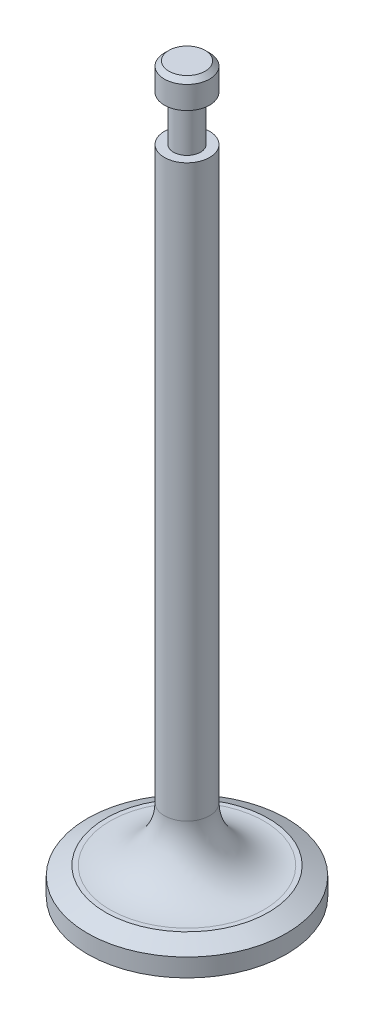
ISO-10303-21;
HEADER;
FILE_DESCRIPTION(('STEP AP214'),'2;1');
FILE_NAME('part.step','',(''),(''),'','','');
FILE_SCHEMA(('AUTOMOTIVE_DESIGN { 1 0 10303 214 1 1 1 1 }'));
ENDSEC;
DATA;
#1=APPLICATION_CONTEXT('core data for automotive mechanical design processes');
#2=APPLICATION_PROTOCOL_DEFINITION('international standard','automotive_design',2000,#1);
#3=PRODUCT_CONTEXT('',#1,'mechanical');
#4=PRODUCT('Part','Part','',(#3));
#5=PRODUCT_RELATED_PRODUCT_CATEGORY('part','',(#4));
#6=PRODUCT_DEFINITION_FORMATION('','',#4);
#7=PRODUCT_DEFINITION_CONTEXT('part definition',#1,'design');
#8=PRODUCT_DEFINITION('design','',#6,#7);
#9=PRODUCT_DEFINITION_SHAPE('','',#8);
#10=(LENGTH_UNIT() NAMED_UNIT(*) SI_UNIT(.MILLI.,.METRE.));
#11=(NAMED_UNIT(*) PLANE_ANGLE_UNIT() SI_UNIT($,.RADIAN.));
#12=(NAMED_UNIT(*) SI_UNIT($,.STERADIAN.) SOLID_ANGLE_UNIT());
#13=UNCERTAINTY_MEASURE_WITH_UNIT(LENGTH_MEASURE(1.E-05),#10,'distance_accuracy_value','');
#14=(GEOMETRIC_REPRESENTATION_CONTEXT(3) GLOBAL_UNCERTAINTY_ASSIGNED_CONTEXT((#13)) GLOBAL_UNIT_ASSIGNED_CONTEXT((#10,
#11,#12)) REPRESENTATION_CONTEXT('',''));
#15=CARTESIAN_POINT('',(0.,0.,0.));
#16=DIRECTION('',(0.,0.,1.));
#17=DIRECTION('',(1.,0.,0.));
#18=AXIS2_PLACEMENT_3D('',#15,#16,#17);
#19=CARTESIAN_POINT('',(11.,0.,0.));
#20=DIRECTION('',(0.,-1.,0.));
#21=DIRECTION('',(0.,0.,-1.));
#22=AXIS2_PLACEMENT_3D('',#19,#20,#21);
#23=PLANE('',#22);
#24=CARTESIAN_POINT('',(0.,0.,0.));
#25=DIRECTION('',(0.,-1.,0.));
#26=DIRECTION('',(0.,0.,-1.));
#27=AXIS2_PLACEMENT_3D('',#24,#25,#26);
#28=CIRCLE('',#27,11.);
#29=CARTESIAN_POINT('',(0.,0.,-11.));
#30=VERTEX_POINT('',#29);
#31=EDGE_CURVE('E76',#30,#30,#28,.T.);
#32=ORIENTED_EDGE('',*,*,#31,.T.);
#33=EDGE_LOOP('',(#32));
#34=FACE_BOUND('',#33,.T.);
#35=ADVANCED_FACE('F37',(#34),#23,.T.);
#36=CARTESIAN_POINT('',(0.,80.,0.));
#37=DIRECTION('',(0.,1.,0.));
#38=DIRECTION('',(0.,0.,1.));
#39=AXIS2_PLACEMENT_3D('',#36,#37,#38);
#40=PLANE('',#39);
#41=CARTESIAN_POINT('',(0.,80.,0.));
#42=DIRECTION('',(0.,1.,0.));
#43=DIRECTION('',(0.,0.,1.));
#44=AXIS2_PLACEMENT_3D('',#41,#42,#43);
#45=CIRCLE('',#44,2.00000000000001);
#46=CARTESIAN_POINT('',(0.,80.,2.00000000000001));
#47=VERTEX_POINT('',#46);
#48=EDGE_CURVE('E49',#47,#47,#45,.T.);
#49=ORIENTED_EDGE('',*,*,#48,.T.);
#50=EDGE_LOOP('',(#49));
#51=FACE_BOUND('',#50,.T.);
#52=ADVANCED_FACE('F96',(#51),#40,.T.);
#53=CARTESIAN_POINT('',(0.,0.,0.));
#54=DIRECTION('',(0.,-1.,0.));
#55=DIRECTION('',(0.,0.,-1.));
#56=AXIS2_PLACEMENT_3D('',#53,#54,#55);
#57=CYLINDRICAL_SURFACE('',#56,2.5);
#58=CARTESIAN_POINT('',(0.,79.5,0.));
#59=DIRECTION('',(0.,1.,0.));
#60=DIRECTION('',(0.,0.,1.));
#61=AXIS2_PLACEMENT_3D('',#58,#59,#60);
#62=CIRCLE('',#61,2.5);
#63=CARTESIAN_POINT('',(0.,79.5,2.5));
#64=VERTEX_POINT('',#63);
#65=EDGE_CURVE('E53',#64,#64,#62,.F.);
#66=ORIENTED_EDGE('',*,*,#65,.T.);
#67=EDGE_LOOP('',(#66));
#68=FACE_BOUND('',#67,.T.);
#69=CARTESIAN_POINT('',(0.,77.,0.));
#70=DIRECTION('',(0.,-1.,0.));
#71=DIRECTION('',(0.,0.,-1.));
#72=AXIS2_PLACEMENT_3D('',#69,#70,#71);
#73=CIRCLE('',#72,2.5);
#74=CARTESIAN_POINT('',(0.,77.,-2.5));
#75=VERTEX_POINT('',#74);
#76=EDGE_CURVE('E64',#75,#75,#73,.T.);
#77=ORIENTED_EDGE('',*,*,#76,.F.);
#78=EDGE_LOOP('',(#77));
#79=FACE_BOUND('',#78,.T.);
#80=ADVANCED_FACE('F101',(#68,#79),#57,.T.);
#81=CARTESIAN_POINT('',(2.5,77.,0.));
#82=DIRECTION('',(0.,-1.,0.));
#83=DIRECTION('',(0.,0.,-1.));
#84=AXIS2_PLACEMENT_3D('',#81,#82,#83);
#85=PLANE('',#84);
#86=ORIENTED_EDGE('',*,*,#76,.T.);
#87=EDGE_LOOP('',(#86));
#88=FACE_BOUND('',#87,.T.);
#89=CARTESIAN_POINT('',(0.,77.,0.));
#90=DIRECTION('',(0.,-1.,0.));
#91=DIRECTION('',(0.,0.,-1.));
#92=AXIS2_PLACEMENT_3D('',#89,#90,#91);
#93=CIRCLE('',#92,1.5);
#94=CARTESIAN_POINT('',(0.,77.,-1.5));
#95=VERTEX_POINT('',#94);
#96=EDGE_CURVE('E67',#95,#95,#93,.T.);
#97=ORIENTED_EDGE('',*,*,#96,.F.);
#98=EDGE_LOOP('',(#97));
#99=FACE_BOUND('',#98,.T.);
#100=ADVANCED_FACE('F120',(#88,#99),#85,.T.);
#101=CARTESIAN_POINT('',(0.,0.,0.));
#102=DIRECTION('',(0.,-1.,0.));
#103=DIRECTION('',(0.,0.,-1.));
#104=AXIS2_PLACEMENT_3D('',#101,#102,#103);
#105=CYLINDRICAL_SURFACE('',#104,1.5);
#106=ORIENTED_EDGE('',*,*,#96,.T.);
#107=EDGE_LOOP('',(#106));
#108=FACE_BOUND('',#107,.T.);
#109=CARTESIAN_POINT('',(0.,72.,0.));
#110=DIRECTION('',(0.,-1.,0.));
#111=DIRECTION('',(0.,0.,-1.));
#112=AXIS2_PLACEMENT_3D('',#109,#110,#111);
#113=CIRCLE('',#112,1.5);
#114=CARTESIAN_POINT('',(0.,72.,-1.5));
#115=VERTEX_POINT('',#114);
#116=EDGE_CURVE('E70',#115,#115,#113,.T.);
#117=ORIENTED_EDGE('',*,*,#116,.F.);
#118=EDGE_LOOP('',(#117));
#119=FACE_BOUND('',#118,.T.);
#120=ADVANCED_FACE('F125',(#108,#119),#105,.T.);
#121=CARTESIAN_POINT('',(1.5,72.,0.));
#122=DIRECTION('',(0.,1.,0.));
#123=DIRECTION('',(0.,0.,1.));
#124=AXIS2_PLACEMENT_3D('',#121,#122,#123);
#125=PLANE('',#124);
#126=ORIENTED_EDGE('',*,*,#116,.T.);
#127=EDGE_LOOP('',(#126));
#128=FACE_BOUND('',#127,.T.);
#129=CARTESIAN_POINT('',(0.,72.,0.));
#130=DIRECTION('',(0.,-1.,0.));
#131=DIRECTION('',(0.,0.,-1.));
#132=AXIS2_PLACEMENT_3D('',#129,#130,#131);
#133=CIRCLE('',#132,2.5);
#134=CARTESIAN_POINT('',(0.,72.,-2.5));
#135=VERTEX_POINT('',#134);
#136=EDGE_CURVE('E73',#135,#135,#133,.T.);
#137=ORIENTED_EDGE('',*,*,#136,.F.);
#138=EDGE_LOOP('',(#137));
#139=FACE_BOUND('',#138,.T.);
#140=ADVANCED_FACE('F131',(#128,#139),#125,.T.);
#141=CARTESIAN_POINT('',(0.,0.,0.));
#142=DIRECTION('',(0.,-1.,0.));
#143=DIRECTION('',(0.,0.,-1.));
#144=AXIS2_PLACEMENT_3D('',#141,#142,#143);
#145=CYLINDRICAL_SURFACE('',#144,2.5);
#146=CARTESIAN_POINT('',(0.,9.,0.));
#147=DIRECTION('',(0.,1.,0.));
#148=DIRECTION('',(0.,0.,1.));
#149=AXIS2_PLACEMENT_3D('',#146,#147,#148);
#150=CIRCLE('',#149,2.5);
#151=CARTESIAN_POINT('',(0.,9.,2.5));
#152=VERTEX_POINT('',#151);
#153=EDGE_CURVE('E58',#152,#152,#150,.T.);
#154=ORIENTED_EDGE('',*,*,#153,.T.);
#155=EDGE_LOOP('',(#154));
#156=FACE_BOUND('',#155,.T.);
#157=ORIENTED_EDGE('',*,*,#136,.T.);
#158=EDGE_LOOP('',(#157));
#159=FACE_BOUND('',#158,.T.);
#160=ADVANCED_FACE('F93',(#156,#159),#145,.T.);
#161=CARTESIAN_POINT('',(2.50000000000001,3.,0.));
#162=DIRECTION('',(0.,1.,0.));
#163=DIRECTION('',(0.,0.,1.));
#164=AXIS2_PLACEMENT_3D('',#161,#162,#163);
#165=PLANE('',#164);
#166=CARTESIAN_POINT('',(0.,3.,0.));
#167=DIRECTION('',(0.,1.,0.));
#168=DIRECTION('',(0.,0.,1.));
#169=AXIS2_PLACEMENT_3D('',#166,#167,#168);
#170=CIRCLE('',#169,8.99999999999998);
#171=CARTESIAN_POINT('',(0.,3.,8.99999999999998));
#172=VERTEX_POINT('',#171);
#173=EDGE_CURVE('E10',#172,#172,#170,.T.);
#174=ORIENTED_EDGE('',*,*,#173,.T.);
#175=EDGE_LOOP('',(#174));
#176=FACE_BOUND('',#175,.T.);
#177=CARTESIAN_POINT('',(0.,3.,0.));
#178=DIRECTION('',(0.,1.,0.));
#179=DIRECTION('',(0.,0.,1.));
#180=AXIS2_PLACEMENT_3D('',#177,#178,#179);
#181=CIRCLE('',#180,8.5);
#182=CARTESIAN_POINT('',(0.,3.,8.5));
#183=VERTEX_POINT('',#182);
#184=EDGE_CURVE('E61',#183,#183,#181,.F.);
#185=ORIENTED_EDGE('',*,*,#184,.T.);
#186=EDGE_LOOP('',(#185));
#187=FACE_BOUND('',#186,.T.);
#188=ADVANCED_FACE('F84',(#176,#187),#165,.T.);
#189=CARTESIAN_POINT('',(0.,0.,0.));
#190=DIRECTION('',(0.,-1.,0.));
#191=DIRECTION('',(0.,0.,-1.));
#192=AXIS2_PLACEMENT_3D('',#189,#190,#191);
#193=CYLINDRICAL_SURFACE('',#192,11.);
#194=CARTESIAN_POINT('',(0.,1.99999999999999,0.));
#195=DIRECTION('',(0.,1.,0.));
#196=DIRECTION('',(0.,0.,1.));
#197=AXIS2_PLACEMENT_3D('',#194,#195,#196);
#198=CIRCLE('',#197,11.);
#199=CARTESIAN_POINT('',(0.,1.99999999999999,11.));
#200=VERTEX_POINT('',#199);
#201=EDGE_CURVE('E45',#200,#200,#198,.F.);
#202=ORIENTED_EDGE('',*,*,#201,.T.);
#203=EDGE_LOOP('',(#202));
#204=FACE_BOUND('',#203,.T.);
#205=ORIENTED_EDGE('',*,*,#31,.F.);
#206=EDGE_LOOP('',(#205));
#207=FACE_BOUND('',#206,.T.);
#208=ADVANCED_FACE('F81',(#204,#207),#193,.T.);
#209=CARTESIAN_POINT('',(0.,9.,0.));
#210=DIRECTION('',(0.,1.,0.));
#211=DIRECTION('',(0.,0.,1.));
#212=AXIS2_PLACEMENT_3D('',#209,#210,#211);
#213=TOROIDAL_SURFACE('',#212,8.5,6.);
#214=ORIENTED_EDGE('',*,*,#153,.F.);
#215=EDGE_LOOP('',(#214));
#216=FACE_BOUND('',#215,.T.);
#217=ORIENTED_EDGE('',*,*,#184,.F.);
#218=EDGE_LOOP('',(#217));
#219=FACE_BOUND('',#218,.T.);
#220=ADVANCED_FACE('F83',(#216,#219),#213,.F.);
#221=CARTESIAN_POINT('',(0.,79.5,0.));
#222=DIRECTION('',(0.,-1.,0.));
#223=DIRECTION('',(0.,0.,-1.));
#224=AXIS2_PLACEMENT_3D('',#221,#222,#223);
#225=CONICAL_SURFACE('',#224,2.5,0.785398163397453);
#226=ORIENTED_EDGE('',*,*,#48,.F.);
#227=EDGE_LOOP('',(#226));
#228=FACE_BOUND('',#227,.T.);
#229=ORIENTED_EDGE('',*,*,#65,.F.);
#230=EDGE_LOOP('',(#229));
#231=FACE_BOUND('',#230,.T.);
#232=ADVANCED_FACE('F90',(#228,#231),#225,.T.);
#233=CARTESIAN_POINT('',(0.,1.99999999999999,0.));
#234=DIRECTION('',(0.,-1.,0.));
#235=DIRECTION('',(0.,0.,-1.));
#236=AXIS2_PLACEMENT_3D('',#233,#234,#235);
#237=CONICAL_SURFACE('',#236,11.,1.10714871779409);
#238=ORIENTED_EDGE('',*,*,#173,.F.);
#239=EDGE_LOOP('',(#238));
#240=FACE_BOUND('',#239,.T.);
#241=ORIENTED_EDGE('',*,*,#201,.F.);
#242=EDGE_LOOP('',(#241));
#243=FACE_BOUND('',#242,.T.);
#244=ADVANCED_FACE('F40',(#240,#243),#237,.T.);
#245=CLOSED_SHELL('',(#35,#52,#80,#100,#120,#140,#160,#188,#208,#220,#232,#244));
#246=MANIFOLD_SOLID_BREP('B2',#245);
#247=ADVANCED_BREP_SHAPE_REPRESENTATION('',(#18,#246),#14);
#248=SHAPE_DEFINITION_REPRESENTATION(#9,#247);
ENDSEC;
END-ISO-10303-21;
